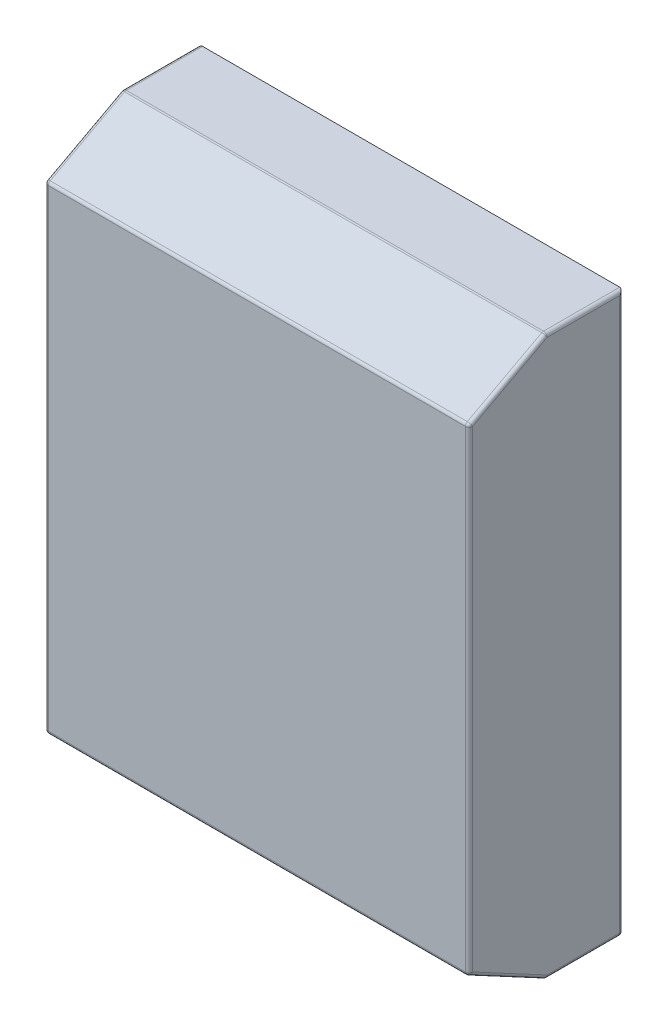
ISO-10303-21;
HEADER;
FILE_DESCRIPTION(('STEP AP214'),'2;1');
FILE_NAME('part.step','',(''),(''),'','','');
FILE_SCHEMA(('AUTOMOTIVE_DESIGN { 1 0 10303 214 1 1 1 1 }'));
ENDSEC;
DATA;
#1=APPLICATION_CONTEXT('core data for automotive mechanical design processes');
#2=APPLICATION_PROTOCOL_DEFINITION('international standard','automotive_design',2000,#1);
#3=PRODUCT_CONTEXT('',#1,'mechanical');
#4=PRODUCT('Part','Part','',(#3));
#5=PRODUCT_RELATED_PRODUCT_CATEGORY('part','',(#4));
#6=PRODUCT_DEFINITION_FORMATION('','',#4);
#7=PRODUCT_DEFINITION_CONTEXT('part definition',#1,'design');
#8=PRODUCT_DEFINITION('design','',#6,#7);
#9=PRODUCT_DEFINITION_SHAPE('','',#8);
#10=(LENGTH_UNIT() NAMED_UNIT(*) SI_UNIT(.MILLI.,.METRE.));
#11=(NAMED_UNIT(*) PLANE_ANGLE_UNIT() SI_UNIT($,.RADIAN.));
#12=(NAMED_UNIT(*) SI_UNIT($,.STERADIAN.) SOLID_ANGLE_UNIT());
#13=UNCERTAINTY_MEASURE_WITH_UNIT(LENGTH_MEASURE(1.E-05),#10,'distance_accuracy_value','');
#14=(GEOMETRIC_REPRESENTATION_CONTEXT(3) GLOBAL_UNCERTAINTY_ASSIGNED_CONTEXT((#13)) GLOBAL_UNIT_ASSIGNED_CONTEXT((#10,
#11,#12)) REPRESENTATION_CONTEXT('',''));
#15=CARTESIAN_POINT('',(0.,0.,0.));
#16=DIRECTION('',(0.,0.,1.));
#17=DIRECTION('',(1.,0.,0.));
#18=AXIS2_PLACEMENT_3D('',#15,#16,#17);
#19=CARTESIAN_POINT('',(-74.0510537034673,169.939067524116,101.6));
#20=DIRECTION('',(1.,0.,0.));
#21=DIRECTION('',(0.,1.,0.));
#22=AXIS2_PLACEMENT_3D('',#19,#20,#21);
#23=PLANE('',#22);
#24=DIRECTION('',(0.,-1.,0.));
#25=VECTOR('',#24,1.);
#26=CARTESIAN_POINT('',(-74.0510537034673,169.939067524116,2.37999999999999));
#27=LINE('',#26,#25);
#28=CARTESIAN_POINT('',(-74.0510537034673,167.559067524116,2.37999999999999));
#29=VERTEX_POINT('',#28);
#30=CARTESIAN_POINT('',(-74.0510537034673,-195.980932475884,2.37999999999999));
#31=VERTEX_POINT('',#30);
#32=EDGE_CURVE('E246',#29,#31,#27,.T.);
#33=ORIENTED_EDGE('',*,*,#32,.T.);
#34=DIRECTION('',(0.,0.,-1.));
#35=VECTOR('',#34,1.);
#36=CARTESIAN_POINT('',(-74.0510537034673,-195.980932475884,101.6));
#37=LINE('',#36,#35);
#38=CARTESIAN_POINT('',(-74.0510537034673,-195.980932475884,50.2034309534252));
#39=VERTEX_POINT('',#38);
#40=EDGE_CURVE('E254',#31,#39,#37,.F.);
#41=ORIENTED_EDGE('',*,*,#40,.T.);
#42=DIRECTION('',(0.,-0.471682672938411,-0.881768368705567));
#43=VECTOR('',#42,1.);
#44=CARTESIAN_POINT('',(-74.0510537034673,-93.1927912794307,242.356623735448));
#45=LINE('',#44,#43);
#46=CARTESIAN_POINT('',(-74.0510537034673,-169.760592614863,99.22));
#47=VERTEX_POINT('',#46);
#48=EDGE_CURVE('E252',#39,#47,#45,.F.);
#49=ORIENTED_EDGE('',*,*,#48,.T.);
#50=DIRECTION('',(0.,-1.,0.));
#51=VECTOR('',#50,1.);
#52=CARTESIAN_POINT('',(-74.0510537034673,142.764720342161,99.22));
#53=LINE('',#52,#51);
#54=CARTESIAN_POINT('',(-74.0510537034673,141.338727663094,99.22));
#55=VERTEX_POINT('',#54);
#56=EDGE_CURVE('E250',#47,#55,#53,.F.);
#57=ORIENTED_EDGE('',*,*,#56,.T.);
#58=DIRECTION('',(0.,-0.471682672938411,0.881768368705567));
#59=VECTOR('',#58,1.);
#60=CARTESIAN_POINT('',(-74.0510537034673,146.711983864566,89.1751804057301));
#61=LINE('',#60,#59);
#62=CARTESIAN_POINT('',(-74.0510537034673,167.559067524116,50.2034309534251));
#63=VERTEX_POINT('',#62);
#64=EDGE_CURVE('E248',#55,#63,#61,.F.);
#65=ORIENTED_EDGE('',*,*,#64,.T.);
#66=DIRECTION('',(0.,0.,-1.));
#67=VECTOR('',#66,1.);
#68=CARTESIAN_POINT('',(-74.0510537034673,167.559067524116,101.6));
#69=LINE('',#68,#67);
#70=EDGE_CURVE('E244',#63,#29,#69,.T.);
#71=ORIENTED_EDGE('',*,*,#70,.T.);
#72=EDGE_LOOP('',(#33,#41,#49,#57,#65,#71));
#73=FACE_BOUND('',#72,.T.);
#74=ADVANCED_FACE('F38',(#73),#23,.F.);
#75=CARTESIAN_POINT('',(-74.0510537034673,-198.360932475884,101.6));
#76=DIRECTION('',(0.,1.,0.));
#77=DIRECTION('',(0.,0.,1.));
#78=AXIS2_PLACEMENT_3D('',#75,#76,#77);
#79=PLANE('',#78);
#80=DIRECTION('',(0.,0.,-1.));
#81=VECTOR('',#80,1.);
#82=CARTESIAN_POINT('',(-71.6710537034673,-198.360932475884,101.6));
#83=LINE('',#82,#81);
#84=CARTESIAN_POINT('',(-71.6710537034673,-198.360932475884,50.2034309534252));
#85=VERTEX_POINT('',#84);
#86=CARTESIAN_POINT('',(-71.6710537034673,-198.360932475884,2.37999999999999));
#87=VERTEX_POINT('',#86);
#88=EDGE_CURVE('E232',#85,#87,#83,.T.);
#89=ORIENTED_EDGE('',*,*,#88,.T.);
#90=DIRECTION('',(1.,0.,0.));
#91=VECTOR('',#90,1.);
#92=CARTESIAN_POINT('',(-74.0510537034673,-198.360932475884,2.37999999999999));
#93=LINE('',#92,#91);
#94=CARTESIAN_POINT('',(202.968946296533,-198.360932475884,2.37999999999999));
#95=VERTEX_POINT('',#94);
#96=EDGE_CURVE('E234',#87,#95,#93,.T.);
#97=ORIENTED_EDGE('',*,*,#96,.T.);
#98=DIRECTION('',(0.,0.,-1.));
#99=VECTOR('',#98,1.);
#100=CARTESIAN_POINT('',(202.968946296533,-198.360932475884,101.6));
#101=LINE('',#100,#99);
#102=CARTESIAN_POINT('',(202.968946296533,-198.360932475884,50.2034309534251));
#103=VERTEX_POINT('',#102);
#104=EDGE_CURVE('E228',#95,#103,#101,.F.);
#105=ORIENTED_EDGE('',*,*,#104,.T.);
#106=DIRECTION('',(-1.,0.,0.));
#107=VECTOR('',#106,1.);
#108=CARTESIAN_POINT('',(-74.0510537034673,-198.360932475884,50.2034309534252));
#109=LINE('',#108,#107);
#110=EDGE_CURVE('E230',#103,#85,#109,.T.);
#111=ORIENTED_EDGE('',*,*,#110,.T.);
#112=EDGE_LOOP('',(#89,#97,#105,#111));
#113=FACE_BOUND('',#112,.T.);
#114=ADVANCED_FACE('F505',(#113),#79,.F.);
#115=CARTESIAN_POINT('',(205.348946296533,169.939067524116,101.6));
#116=DIRECTION('',(-1.,0.,0.));
#117=DIRECTION('',(0.,0.,1.));
#118=AXIS2_PLACEMENT_3D('',#115,#116,#117);
#119=PLANE('',#118);
#120=DIRECTION('',(0.,-0.471682672938411,-0.881768368705567));
#121=VECTOR('',#120,1.);
#122=CARTESIAN_POINT('',(205.348946296533,-93.1927912794306,242.356623735448));
#123=LINE('',#122,#121);
#124=CARTESIAN_POINT('',(205.348946296533,-169.760592614863,99.22));
#125=VERTEX_POINT('',#124);
#126=CARTESIAN_POINT('',(205.348946296533,-195.980932475884,50.2034309534249));
#127=VERTEX_POINT('',#126);
#128=EDGE_CURVE('E274',#125,#127,#123,.T.);
#129=ORIENTED_EDGE('',*,*,#128,.T.);
#130=DIRECTION('',(0.,0.,-1.));
#131=VECTOR('',#130,1.);
#132=CARTESIAN_POINT('',(205.348946296533,-195.980932475884,101.6));
#133=LINE('',#132,#131);
#134=CARTESIAN_POINT('',(205.348946296533,-195.980932475884,2.37999999999999));
#135=VERTEX_POINT('',#134);
#136=EDGE_CURVE('E276',#127,#135,#133,.T.);
#137=ORIENTED_EDGE('',*,*,#136,.T.);
#138=DIRECTION('',(0.,1.,0.));
#139=VECTOR('',#138,1.);
#140=CARTESIAN_POINT('',(205.348946296533,169.939067524116,2.37999999999999));
#141=LINE('',#140,#139);
#142=CARTESIAN_POINT('',(205.348946296533,167.559067524116,2.37999999999999));
#143=VERTEX_POINT('',#142);
#144=EDGE_CURVE('E272',#135,#143,#141,.T.);
#145=ORIENTED_EDGE('',*,*,#144,.T.);
#146=DIRECTION('',(0.,0.,-1.));
#147=VECTOR('',#146,1.);
#148=CARTESIAN_POINT('',(205.348946296533,167.559067524116,101.6));
#149=LINE('',#148,#147);
#150=CARTESIAN_POINT('',(205.348946296533,167.559067524116,50.2034309534253));
#151=VERTEX_POINT('',#150);
#152=EDGE_CURVE('E268',#143,#151,#149,.F.);
#153=ORIENTED_EDGE('',*,*,#152,.T.);
#154=DIRECTION('',(0.,-0.471682672938411,0.881768368705567));
#155=VECTOR('',#154,1.);
#156=CARTESIAN_POINT('',(205.348946296533,146.711983864567,89.1751804057302));
#157=LINE('',#156,#155);
#158=CARTESIAN_POINT('',(205.348946296533,141.338727663094,99.22));
#159=VERTEX_POINT('',#158);
#160=EDGE_CURVE('E266',#151,#159,#157,.T.);
#161=ORIENTED_EDGE('',*,*,#160,.T.);
#162=DIRECTION('',(0.,1.,0.));
#163=VECTOR('',#162,1.);
#164=CARTESIAN_POINT('',(205.348946296533,-171.186585293929,99.22));
#165=LINE('',#164,#163);
#166=EDGE_CURVE('E270',#159,#125,#165,.F.);
#167=ORIENTED_EDGE('',*,*,#166,.T.);
#168=EDGE_LOOP('',(#129,#137,#145,#153,#161,#167));
#169=FACE_BOUND('',#168,.T.);
#170=ADVANCED_FACE('F507',(#169),#119,.F.);
#171=CARTESIAN_POINT('',(-74.0510537034673,169.939067524116,101.6));
#172=DIRECTION('',(0.,-1.,0.));
#173=DIRECTION('',(1.,0.,0.));
#174=AXIS2_PLACEMENT_3D('',#171,#172,#173);
#175=PLANE('',#174);
#176=DIRECTION('',(-1.,0.,0.));
#177=VECTOR('',#176,1.);
#178=CARTESIAN_POINT('',(-74.0510537034673,169.939067524116,50.2034309534251));
#179=LINE('',#178,#177);
#180=CARTESIAN_POINT('',(-71.6710537034673,169.939067524116,50.2034309534251));
#181=VERTEX_POINT('',#180);
#182=CARTESIAN_POINT('',(202.968946296533,169.939067524116,50.2034309534253));
#183=VERTEX_POINT('',#182);
#184=EDGE_CURVE('E47',#181,#183,#179,.F.);
#185=ORIENTED_EDGE('',*,*,#184,.T.);
#186=DIRECTION('',(0.,0.,-1.));
#187=VECTOR('',#186,1.);
#188=CARTESIAN_POINT('',(202.968946296533,169.939067524116,101.6));
#189=LINE('',#188,#187);
#190=CARTESIAN_POINT('',(202.968946296533,169.939067524116,0.));
#191=VERTEX_POINT('',#190);
#192=EDGE_CURVE('E11',#183,#191,#189,.T.);
#193=ORIENTED_EDGE('',*,*,#192,.T.);
#194=DIRECTION('',(-1.,0.,0.));
#195=VECTOR('',#194,1.);
#196=CARTESIAN_POINT('',(-74.0510537034673,169.939067524116,0.));
#197=LINE('',#196,#195);
#198=CARTESIAN_POINT('',(-71.6710537034673,169.939067524116,0.));
#199=VERTEX_POINT('',#198);
#200=EDGE_CURVE('E213',#191,#199,#197,.T.);
#201=ORIENTED_EDGE('',*,*,#200,.T.);
#202=DIRECTION('',(0.,0.,-1.));
#203=VECTOR('',#202,1.);
#204=CARTESIAN_POINT('',(-71.6710537034673,169.939067524116,101.6));
#205=LINE('',#204,#203);
#206=EDGE_CURVE('E58',#199,#181,#205,.F.);
#207=ORIENTED_EDGE('',*,*,#206,.T.);
#208=EDGE_LOOP('',(#185,#193,#201,#207));
#209=FACE_BOUND('',#208,.T.);
#210=ADVANCED_FACE('F487',(#209),#175,.F.);
#211=CARTESIAN_POINT('',(0.,0.,101.6));
#212=DIRECTION('',(0.,0.,1.));
#213=DIRECTION('',(1.,0.,0.));
#214=AXIS2_PLACEMENT_3D('',#211,#212,#213);
#215=PLANE('',#214);
#216=DIRECTION('',(0.,-1.,0.));
#217=VECTOR('',#216,1.);
#218=CARTESIAN_POINT('',(-71.6710537034673,-171.186585293929,101.6));
#219=LINE('',#218,#217);
#220=CARTESIAN_POINT('',(-71.6710537034673,141.338727663094,101.6));
#221=VERTEX_POINT('',#220);
#222=CARTESIAN_POINT('',(-71.6710537034673,-169.760592614863,101.6));
#223=VERTEX_POINT('',#222);
#224=EDGE_CURVE('E283',#221,#223,#219,.T.);
#225=ORIENTED_EDGE('',*,*,#224,.T.);
#226=DIRECTION('',(-1.,0.,0.));
#227=VECTOR('',#226,1.);
#228=CARTESIAN_POINT('',(205.348946296533,-169.760592614863,101.6));
#229=LINE('',#228,#227);
#230=CARTESIAN_POINT('',(202.968946296533,-169.760592614863,101.6));
#231=VERTEX_POINT('',#230);
#232=EDGE_CURVE('E285',#223,#231,#229,.F.);
#233=ORIENTED_EDGE('',*,*,#232,.T.);
#234=DIRECTION('',(0.,1.,0.));
#235=VECTOR('',#234,1.);
#236=CARTESIAN_POINT('',(202.968946296533,142.764720342161,101.6));
#237=LINE('',#236,#235);
#238=CARTESIAN_POINT('',(202.968946296533,141.338727663094,101.6));
#239=VERTEX_POINT('',#238);
#240=EDGE_CURVE('E281',#231,#239,#237,.T.);
#241=ORIENTED_EDGE('',*,*,#240,.T.);
#242=DIRECTION('',(1.,0.,0.));
#243=VECTOR('',#242,1.);
#244=CARTESIAN_POINT('',(-74.0510537034672,141.338727663094,101.6));
#245=LINE('',#244,#243);
#246=EDGE_CURVE('E279',#239,#221,#245,.F.);
#247=ORIENTED_EDGE('',*,*,#246,.T.);
#248=EDGE_LOOP('',(#225,#233,#241,#247));
#249=FACE_BOUND('',#248,.T.);
#250=ADVANCED_FACE('F419',(#249),#215,.T.);
#251=CARTESIAN_POINT('',(0.,0.,0.));
#252=DIRECTION('',(0.,0.,1.));
#253=DIRECTION('',(1.,0.,0.));
#254=AXIS2_PLACEMENT_3D('',#251,#252,#253);
#255=PLANE('',#254);
#256=ORIENTED_EDGE('',*,*,#200,.F.);
#257=DIRECTION('',(0.,1.,0.));
#258=VECTOR('',#257,1.);
#259=CARTESIAN_POINT('',(202.968946296533,0.,0.));
#260=LINE('',#259,#258);
#261=CARTESIAN_POINT('',(202.968946296533,-195.980932475884,0.));
#262=VERTEX_POINT('',#261);
#263=EDGE_CURVE('E242',#191,#262,#260,.F.);
#264=ORIENTED_EDGE('',*,*,#263,.T.);
#265=DIRECTION('',(1.,0.,0.));
#266=VECTOR('',#265,1.);
#267=CARTESIAN_POINT('',(0.,-195.980932475884,0.));
#268=LINE('',#267,#266);
#269=CARTESIAN_POINT('',(-71.6710537034673,-195.980932475884,0.));
#270=VERTEX_POINT('',#269);
#271=EDGE_CURVE('E239',#262,#270,#268,.F.);
#272=ORIENTED_EDGE('',*,*,#271,.T.);
#273=DIRECTION('',(0.,-1.,0.));
#274=VECTOR('',#273,1.);
#275=CARTESIAN_POINT('',(-71.6710537034673,0.,0.));
#276=LINE('',#275,#274);
#277=EDGE_CURVE('E237',#270,#199,#276,.F.);
#278=ORIENTED_EDGE('',*,*,#277,.T.);
#279=EDGE_LOOP('',(#256,#264,#272,#278));
#280=FACE_BOUND('',#279,.T.);
#281=ADVANCED_FACE('F489',(#280),#255,.F.);
#282=CARTESIAN_POINT('',(269.610946296533,-198.360932475884,50.8));
#283=DIRECTION('',(0.,0.881768368705567,-0.471682672938411));
#284=DIRECTION('',(0.,0.471682672938411,0.881768368705567));
#285=AXIS2_PLACEMENT_3D('',#282,#283,#284);
#286=PLANE('',#285);
#287=DIRECTION('',(-1.,0.,0.));
#288=VECTOR('',#287,1.);
#289=CARTESIAN_POINT('',(-74.0510537034671,-171.859201332382,100.342604761593));
#290=LINE('',#289,#288);
#291=CARTESIAN_POINT('',(202.968946296533,-171.859201332382,100.342604761593));
#292=VERTEX_POINT('',#291);
#293=CARTESIAN_POINT('',(-71.6710537034673,-171.859201332382,100.342604761593));
#294=VERTEX_POINT('',#293);
#295=EDGE_CURVE('E259',#292,#294,#290,.T.);
#296=ORIENTED_EDGE('',*,*,#295,.T.);
#297=DIRECTION('',(0.,-0.471682672938411,-0.881768368705567));
#298=VECTOR('',#297,1.);
#299=CARTESIAN_POINT('',(-71.6710537034673,-198.360932475884,50.8));
#300=LINE('',#299,#298);
#301=CARTESIAN_POINT('',(-71.6710537034673,-198.079541193403,51.3260357150186));
#302=VERTEX_POINT('',#301);
#303=EDGE_CURVE('E264',#294,#302,#300,.T.);
#304=ORIENTED_EDGE('',*,*,#303,.T.);
#305=DIRECTION('',(-1.,0.,0.));
#306=VECTOR('',#305,1.);
#307=CARTESIAN_POINT('',(269.610946296533,-198.079541193403,51.3260357150184));
#308=LINE('',#307,#306);
#309=CARTESIAN_POINT('',(202.968946296533,-198.079541193403,51.3260357150185));
#310=VERTEX_POINT('',#309);
#311=EDGE_CURVE('E261',#302,#310,#308,.F.);
#312=ORIENTED_EDGE('',*,*,#311,.T.);
#313=DIRECTION('',(0.,-0.471682672938411,-0.881768368705567));
#314=VECTOR('',#313,1.);
#315=CARTESIAN_POINT('',(202.968946296533,-198.360932475884,50.8));
#316=LINE('',#315,#314);
#317=EDGE_CURVE('E257',#310,#292,#316,.F.);
#318=ORIENTED_EDGE('',*,*,#317,.T.);
#319=EDGE_LOOP('',(#296,#304,#312,#318));
#320=FACE_BOUND('',#319,.T.);
#321=DIRECTION('',(-1.,0.,0.));
#322=VECTOR('',#321,1.);
#323=CARTESIAN_POINT('',(269.610946296533,-188.999211424342,68.3008962030973));
#324=LINE('',#323,#322);
#325=CARTESIAN_POINT('',(178.763791471281,-188.999211424342,68.3008962030973));
#326=VERTEX_POINT('',#325);
#327=CARTESIAN_POINT('',(-47.465898878216,-188.999211424342,68.3008962030973));
#328=VERTEX_POINT('',#327);
#329=EDGE_CURVE('E219',#326,#328,#324,.T.);
#330=ORIENTED_EDGE('',*,*,#329,.T.);
#331=CARTESIAN_POINT('',(-47.465898878216,-183.904021327726,77.8258962030973));
#332=DIRECTION('',(0.,0.881768368705567,-0.471682672938411));
#333=DIRECTION('',(0.,-0.471682672938411,-0.881768368705567));
#334=AXIS2_PLACEMENT_3D('',#331,#332,#333);
#335=ELLIPSE('',#334,10.802156595822,9.525);
#336=CARTESIAN_POINT('',(-47.465898878216,-178.808831231109,87.3508962030973));
#337=VERTEX_POINT('',#336);
#338=EDGE_CURVE('E188',#328,#337,#335,.T.);
#339=ORIENTED_EDGE('',*,*,#338,.T.);
#340=DIRECTION('',(1.,0.,0.));
#341=VECTOR('',#340,1.);
#342=CARTESIAN_POINT('',(269.610946296533,-178.808831231109,87.3508962030973));
#343=LINE('',#342,#341);
#344=CARTESIAN_POINT('',(178.763791471281,-178.808831231109,87.3508962030973));
#345=VERTEX_POINT('',#344);
#346=EDGE_CURVE('E224',#337,#345,#343,.T.);
#347=ORIENTED_EDGE('',*,*,#346,.T.);
#348=CARTESIAN_POINT('',(178.763791471281,-183.904021327726,77.8258962030973));
#349=DIRECTION('',(0.,0.881768368705567,-0.471682672938411));
#350=DIRECTION('',(0.,-0.471682672938411,-0.881768368705567));
#351=AXIS2_PLACEMENT_3D('',#348,#349,#350);
#352=ELLIPSE('',#351,10.802156595822,9.525);
#353=EDGE_CURVE('E221',#345,#326,#352,.T.);
#354=ORIENTED_EDGE('',*,*,#353,.T.);
#355=EDGE_LOOP('',(#330,#339,#347,#354));
#356=FACE_BOUND('',#355,.T.);
#357=ADVANCED_FACE('F457',(#320,#356),#286,.F.);
#358=CARTESIAN_POINT('',(269.610946296533,169.939067524116,50.8));
#359=DIRECTION('',(0.,-0.881768368705567,-0.471682672938411));
#360=DIRECTION('',(0.,0.471682672938411,-0.881768368705567));
#361=AXIS2_PLACEMENT_3D('',#358,#359,#360);
#362=PLANE('',#361);
#363=DIRECTION('',(0.,-0.471682672938411,0.881768368705567));
#364=VECTOR('',#363,1.);
#365=CARTESIAN_POINT('',(-71.6710537034673,169.939067524116,50.8));
#366=LINE('',#365,#364);
#367=CARTESIAN_POINT('',(-71.6710537034673,169.657676241635,51.3260357150185));
#368=VERTEX_POINT('',#367);
#369=CARTESIAN_POINT('',(-71.6710537034673,143.437336380613,100.342604761593));
#370=VERTEX_POINT('',#369);
#371=EDGE_CURVE('E290',#368,#370,#366,.T.);
#372=ORIENTED_EDGE('',*,*,#371,.T.);
#373=DIRECTION('',(1.,0.,0.));
#374=VECTOR('',#373,1.);
#375=CARTESIAN_POINT('',(205.348946296533,143.437336380613,100.342604761593));
#376=LINE('',#375,#374);
#377=CARTESIAN_POINT('',(202.968946296533,143.437336380613,100.342604761593));
#378=VERTEX_POINT('',#377);
#379=EDGE_CURVE('E294',#370,#378,#376,.T.);
#380=ORIENTED_EDGE('',*,*,#379,.T.);
#381=DIRECTION('',(0.,-0.471682672938411,0.881768368705567));
#382=VECTOR('',#381,1.);
#383=CARTESIAN_POINT('',(202.968946296533,169.939067524116,50.8));
#384=LINE('',#383,#382);
#385=CARTESIAN_POINT('',(202.968946296533,169.657676241635,51.3260357150187));
#386=VERTEX_POINT('',#385);
#387=EDGE_CURVE('E292',#378,#386,#384,.F.);
#388=ORIENTED_EDGE('',*,*,#387,.T.);
#389=DIRECTION('',(-1.,0.,0.));
#390=VECTOR('',#389,1.);
#391=CARTESIAN_POINT('',(269.610946296533,169.657676241635,51.3260357150187));
#392=LINE('',#391,#390);
#393=EDGE_CURVE('E288',#386,#368,#392,.T.);
#394=ORIENTED_EDGE('',*,*,#393,.T.);
#395=EDGE_LOOP('',(#372,#380,#388,#394));
#396=FACE_BOUND('',#395,.T.);
#397=ADVANCED_FACE('F426',(#396),#362,.F.);
#398=CARTESIAN_POINT('',(-47.465898878216,-119.112932475884,77.8258962030973));
#399=DIRECTION('',(0.,-1.,0.));
#400=DIRECTION('',(0.,0.,-1.));
#401=AXIS2_PLACEMENT_3D('',#398,#399,#400);
#402=CYLINDRICAL_SURFACE('',#401,9.525);
#403=DIRECTION('',(0.,-1.,0.));
#404=VECTOR('',#403,1.);
#405=CARTESIAN_POINT('',(-47.465898878216,-119.112932475884,68.3008962030973));
#406=LINE('',#405,#404);
#407=CARTESIAN_POINT('',(-47.465898878216,-119.112932475884,68.3008962030973));
#408=VERTEX_POINT('',#407);
#409=EDGE_CURVE('E180',#408,#328,#406,.T.);
#410=ORIENTED_EDGE('',*,*,#409,.F.);
#411=CARTESIAN_POINT('',(-47.465898878216,-119.112932475884,77.8258962030973));
#412=DIRECTION('',(0.,-1.,0.));
#413=DIRECTION('',(0.,0.,1.));
#414=AXIS2_PLACEMENT_3D('',#411,#412,#413);
#415=CIRCLE('',#414,9.525);
#416=CARTESIAN_POINT('',(-47.465898878216,-119.112932475884,87.3508962030973));
#417=VERTEX_POINT('',#416);
#418=EDGE_CURVE('E185',#417,#408,#415,.T.);
#419=ORIENTED_EDGE('',*,*,#418,.F.);
#420=DIRECTION('',(0.,-1.,0.));
#421=VECTOR('',#420,1.);
#422=CARTESIAN_POINT('',(-47.465898878216,-119.112932475884,87.3508962030973));
#423=LINE('',#422,#421);
#424=EDGE_CURVE('E211',#417,#337,#423,.T.);
#425=ORIENTED_EDGE('',*,*,#424,.T.);
#426=ORIENTED_EDGE('',*,*,#338,.F.);
#427=EDGE_LOOP('',(#410,#419,#425,#426));
#428=FACE_BOUND('',#427,.T.);
#429=ADVANCED_FACE('F182',(#428),#402,.F.);
#430=CARTESIAN_POINT('',(-47.465898878216,-119.112932475884,87.3508962030973));
#431=DIRECTION('',(0.,0.,1.));
#432=DIRECTION('',(1.,0.,0.));
#433=AXIS2_PLACEMENT_3D('',#430,#431,#432);
#434=PLANE('',#433);
#435=ORIENTED_EDGE('',*,*,#424,.F.);
#436=DIRECTION('',(-1.,0.,0.));
#437=VECTOR('',#436,1.);
#438=CARTESIAN_POINT('',(-47.465898878216,-119.112932475884,87.3508962030973));
#439=LINE('',#438,#437);
#440=CARTESIAN_POINT('',(178.763791471281,-119.112932475884,87.3508962030973));
#441=VERTEX_POINT('',#440);
#442=EDGE_CURVE('E192',#441,#417,#439,.T.);
#443=ORIENTED_EDGE('',*,*,#442,.F.);
#444=DIRECTION('',(0.,-1.,0.));
#445=VECTOR('',#444,1.);
#446=CARTESIAN_POINT('',(178.763791471281,-119.112932475884,87.3508962030973));
#447=LINE('',#446,#445);
#448=EDGE_CURVE('E214',#441,#345,#447,.T.);
#449=ORIENTED_EDGE('',*,*,#448,.T.);
#450=ORIENTED_EDGE('',*,*,#346,.F.);
#451=EDGE_LOOP('',(#435,#443,#449,#450));
#452=FACE_BOUND('',#451,.T.);
#453=ADVANCED_FACE('F587',(#452),#434,.F.);
#454=CARTESIAN_POINT('',(178.763791471281,-119.112932475884,77.8258962030973));
#455=DIRECTION('',(0.,-1.,0.));
#456=DIRECTION('',(0.,0.,-1.));
#457=AXIS2_PLACEMENT_3D('',#454,#455,#456);
#458=CYLINDRICAL_SURFACE('',#457,9.525);
#459=ORIENTED_EDGE('',*,*,#448,.F.);
#460=CARTESIAN_POINT('',(178.763791471281,-119.112932475884,77.8258962030973));
#461=DIRECTION('',(0.,-1.,0.));
#462=DIRECTION('',(0.,0.,-1.));
#463=AXIS2_PLACEMENT_3D('',#460,#461,#462);
#464=CIRCLE('',#463,9.525);
#465=CARTESIAN_POINT('',(178.763791471281,-119.112932475884,68.3008962030973));
#466=VERTEX_POINT('',#465);
#467=EDGE_CURVE('E201',#466,#441,#464,.T.);
#468=ORIENTED_EDGE('',*,*,#467,.F.);
#469=DIRECTION('',(0.,-1.,0.));
#470=VECTOR('',#469,1.);
#471=CARTESIAN_POINT('',(178.763791471281,-119.112932475884,68.3008962030973));
#472=LINE('',#471,#470);
#473=EDGE_CURVE('E191',#466,#326,#472,.T.);
#474=ORIENTED_EDGE('',*,*,#473,.T.);
#475=ORIENTED_EDGE('',*,*,#353,.F.);
#476=EDGE_LOOP('',(#459,#468,#474,#475));
#477=FACE_BOUND('',#476,.T.);
#478=ADVANCED_FACE('F584',(#477),#458,.F.);
#479=CARTESIAN_POINT('',(178.763791471281,-119.112932475884,68.3008962030973));
#480=DIRECTION('',(0.,0.,-1.));
#481=DIRECTION('',(-1.,0.,0.));
#482=AXIS2_PLACEMENT_3D('',#479,#480,#481);
#483=PLANE('',#482);
#484=ORIENTED_EDGE('',*,*,#473,.F.);
#485=DIRECTION('',(1.,0.,0.));
#486=VECTOR('',#485,1.);
#487=CARTESIAN_POINT('',(178.763791471281,-119.112932475884,68.3008962030973));
#488=LINE('',#487,#486);
#489=EDGE_CURVE('E195',#408,#466,#488,.T.);
#490=ORIENTED_EDGE('',*,*,#489,.F.);
#491=ORIENTED_EDGE('',*,*,#409,.T.);
#492=ORIENTED_EDGE('',*,*,#329,.F.);
#493=EDGE_LOOP('',(#484,#490,#491,#492));
#494=FACE_BOUND('',#493,.T.);
#495=ADVANCED_FACE('F196',(#494),#483,.F.);
#496=CARTESIAN_POINT('',(-47.465898878216,-119.112932475884,77.8258962030973));
#497=DIRECTION('',(0.,1.,0.));
#498=DIRECTION('',(0.,0.,1.));
#499=AXIS2_PLACEMENT_3D('',#496,#497,#498);
#500=PLANE('',#499);
#501=ORIENTED_EDGE('',*,*,#418,.T.);
#502=ORIENTED_EDGE('',*,*,#489,.T.);
#503=ORIENTED_EDGE('',*,*,#467,.T.);
#504=ORIENTED_EDGE('',*,*,#442,.T.);
#505=EDGE_LOOP('',(#501,#502,#503,#504));
#506=FACE_BOUND('',#505,.T.);
#507=ADVANCED_FACE('F203',(#506),#500,.F.);
#508=CARTESIAN_POINT('',(269.610946296533,141.338727663094,99.22));
#509=DIRECTION('',(-1.,0.,0.));
#510=DIRECTION('',(0.,-1.,0.));
#511=AXIS2_PLACEMENT_3D('',#508,#509,#510);
#512=CYLINDRICAL_SURFACE('',#511,2.38);
#513=CARTESIAN_POINT('',(-71.6710537034673,141.338727663094,99.22));
#514=DIRECTION('',(-1.,0.,0.));
#515=DIRECTION('',(0.,-1.,0.));
#516=AXIS2_PLACEMENT_3D('',#513,#514,#515);
#517=CIRCLE('',#516,2.38);
#518=EDGE_CURVE('E42',#221,#370,#517,.T.);
#519=ORIENTED_EDGE('',*,*,#518,.F.);
#520=ORIENTED_EDGE('',*,*,#246,.F.);
#521=CARTESIAN_POINT('',(202.968946296533,141.338727663094,99.22));
#522=DIRECTION('',(1.,0.,0.));
#523=DIRECTION('',(0.,0.,-1.));
#524=AXIS2_PLACEMENT_3D('',#521,#522,#523);
#525=CIRCLE('',#524,2.38);
#526=EDGE_CURVE('E377',#378,#239,#525,.T.);
#527=ORIENTED_EDGE('',*,*,#526,.F.);
#528=ORIENTED_EDGE('',*,*,#379,.F.);
#529=EDGE_LOOP('',(#519,#520,#527,#528));
#530=FACE_BOUND('',#529,.T.);
#531=ADVANCED_FACE('F40',(#530),#512,.T.);
#532=CARTESIAN_POINT('',(-71.6710537034673,141.338727663094,99.22));
#533=DIRECTION('',(0.,0.,1.));
#534=DIRECTION('',(1.,0.,0.));
#535=AXIS2_PLACEMENT_3D('',#532,#533,#534);
#536=SPHERICAL_SURFACE('',#535,2.38);
#537=CARTESIAN_POINT('',(-71.6710537034673,141.338727663094,99.22));
#538=DIRECTION('',(0.,-0.471682672938411,0.881768368705567));
#539=DIRECTION('',(0.,-0.881768368705567,-0.471682672938411));
#540=AXIS2_PLACEMENT_3D('',#537,#538,#539);
#541=CIRCLE('',#540,2.38);
#542=EDGE_CURVE('E374',#55,#370,#541,.F.);
#543=ORIENTED_EDGE('',*,*,#542,.F.);
#544=CARTESIAN_POINT('',(-71.6710537034673,141.338727663094,99.22));
#545=DIRECTION('',(0.,1.,0.));
#546=DIRECTION('',(0.,0.,1.));
#547=AXIS2_PLACEMENT_3D('',#544,#545,#546);
#548=CIRCLE('',#547,2.38);
#549=EDGE_CURVE('E207',#221,#55,#548,.F.);
#550=ORIENTED_EDGE('',*,*,#549,.F.);
#551=ORIENTED_EDGE('',*,*,#518,.T.);
#552=EDGE_LOOP('',(#543,#550,#551));
#553=FACE_BOUND('',#552,.T.);
#554=ADVANCED_FACE('F392',(#553),#536,.T.);
#555=CARTESIAN_POINT('',(-71.6710537034673,0.,99.22));
#556=DIRECTION('',(0.,1.,0.));
#557=DIRECTION('',(-1.,0.,0.));
#558=AXIS2_PLACEMENT_3D('',#555,#556,#557);
#559=CYLINDRICAL_SURFACE('',#558,2.38);
#560=ORIENTED_EDGE('',*,*,#549,.T.);
#561=ORIENTED_EDGE('',*,*,#56,.F.);
#562=CARTESIAN_POINT('',(-71.6710537034673,-169.760592614863,99.22));
#563=DIRECTION('',(0.,-1.,0.));
#564=DIRECTION('',(1.,0.,0.));
#565=AXIS2_PLACEMENT_3D('',#562,#563,#564);
#566=CIRCLE('',#565,2.38);
#567=EDGE_CURVE('E371',#223,#47,#566,.T.);
#568=ORIENTED_EDGE('',*,*,#567,.F.);
#569=ORIENTED_EDGE('',*,*,#224,.F.);
#570=EDGE_LOOP('',(#560,#561,#568,#569));
#571=FACE_BOUND('',#570,.T.);
#572=ADVANCED_FACE('F388',(#571),#559,.T.);
#573=CARTESIAN_POINT('',(269.610946296533,-169.760592614863,99.22));
#574=DIRECTION('',(1.,0.,0.));
#575=DIRECTION('',(0.,1.,0.));
#576=AXIS2_PLACEMENT_3D('',#573,#574,#575);
#577=CYLINDRICAL_SURFACE('',#576,2.38);
#578=CARTESIAN_POINT('',(202.968946296533,-169.760592614863,99.22));
#579=DIRECTION('',(1.,0.,0.));
#580=DIRECTION('',(0.,0.,-1.));
#581=AXIS2_PLACEMENT_3D('',#578,#579,#580);
#582=CIRCLE('',#581,2.38);
#583=EDGE_CURVE('E365',#231,#292,#582,.T.);
#584=ORIENTED_EDGE('',*,*,#583,.F.);
#585=ORIENTED_EDGE('',*,*,#232,.F.);
#586=CARTESIAN_POINT('',(-71.6710537034673,-169.760592614863,99.22));
#587=DIRECTION('',(-1.,0.,0.));
#588=DIRECTION('',(0.,0.,1.));
#589=AXIS2_PLACEMENT_3D('',#586,#587,#588);
#590=CIRCLE('',#589,2.38);
#591=EDGE_CURVE('E368',#294,#223,#590,.T.);
#592=ORIENTED_EDGE('',*,*,#591,.F.);
#593=ORIENTED_EDGE('',*,*,#295,.F.);
#594=EDGE_LOOP('',(#584,#585,#592,#593));
#595=FACE_BOUND('',#594,.T.);
#596=ADVANCED_FACE('F416',(#595),#577,.T.);
#597=CARTESIAN_POINT('',(202.968946296533,0.,99.22));
#598=DIRECTION('',(0.,-1.,0.));
#599=DIRECTION('',(0.,0.,-1.));
#600=AXIS2_PLACEMENT_3D('',#597,#598,#599);
#601=CYLINDRICAL_SURFACE('',#600,2.38);
#602=CARTESIAN_POINT('',(202.968946296533,141.338727663094,99.22));
#603=DIRECTION('',(0.,1.,0.));
#604=DIRECTION('',(0.,0.,1.));
#605=AXIS2_PLACEMENT_3D('',#602,#603,#604);
#606=CIRCLE('',#605,2.38);
#607=EDGE_CURVE('E380',#239,#159,#606,.T.);
#608=ORIENTED_EDGE('',*,*,#607,.F.);
#609=ORIENTED_EDGE('',*,*,#240,.F.);
#610=CARTESIAN_POINT('',(202.968946296533,-169.760592614863,99.22));
#611=DIRECTION('',(0.,-1.,0.));
#612=DIRECTION('',(0.,0.,-1.));
#613=AXIS2_PLACEMENT_3D('',#610,#611,#612);
#614=CIRCLE('',#613,2.38);
#615=EDGE_CURVE('E363',#125,#231,#614,.T.);
#616=ORIENTED_EDGE('',*,*,#615,.F.);
#617=ORIENTED_EDGE('',*,*,#166,.F.);
#618=EDGE_LOOP('',(#608,#609,#616,#617));
#619=FACE_BOUND('',#618,.T.);
#620=ADVANCED_FACE('F470',(#619),#601,.T.);
#621=CARTESIAN_POINT('',(202.968946296533,141.338727663094,99.22));
#622=DIRECTION('',(0.,0.,1.));
#623=DIRECTION('',(1.,0.,0.));
#624=AXIS2_PLACEMENT_3D('',#621,#622,#623);
#625=SPHERICAL_SURFACE('',#624,2.38);
#626=ORIENTED_EDGE('',*,*,#526,.T.);
#627=ORIENTED_EDGE('',*,*,#607,.T.);
#628=CARTESIAN_POINT('',(202.968946296533,141.338727663094,99.22));
#629=DIRECTION('',(0.,-0.471682672938411,0.881768368705567));
#630=DIRECTION('',(0.,-0.881768368705567,-0.471682672938411));
#631=AXIS2_PLACEMENT_3D('',#628,#629,#630);
#632=CIRCLE('',#631,2.38);
#633=EDGE_CURVE('E360',#378,#159,#632,.F.);
#634=ORIENTED_EDGE('',*,*,#633,.F.);
#635=EDGE_LOOP('',(#626,#627,#634));
#636=FACE_BOUND('',#635,.T.);
#637=ADVANCED_FACE('F473',(#636),#625,.T.);
#638=CARTESIAN_POINT('',(-71.6710537034673,167.840458806597,49.6773952384066));
#639=DIRECTION('',(0.,-0.471682672938411,0.881768368705567));
#640=DIRECTION('',(0.,-0.881768368705567,-0.471682672938411));
#641=AXIS2_PLACEMENT_3D('',#638,#639,#640);
#642=CYLINDRICAL_SURFACE('',#641,2.38);
#643=ORIENTED_EDGE('',*,*,#542,.T.);
#644=ORIENTED_EDGE('',*,*,#371,.F.);
#645=CARTESIAN_POINT('',(-71.6710537034673,167.559067524116,50.2034309534251));
#646=DIRECTION('',(0.,0.471682672938401,-0.881768368705572));
#647=DIRECTION('',(0.,0.881768368705572,0.471682672938402));
#648=AXIS2_PLACEMENT_3D('',#645,#646,#647);
#649=CIRCLE('',#648,2.38);
#650=EDGE_CURVE('E354',#63,#368,#649,.T.);
#651=ORIENTED_EDGE('',*,*,#650,.F.);
#652=ORIENTED_EDGE('',*,*,#64,.F.);
#653=EDGE_LOOP('',(#643,#644,#651,#652));
#654=FACE_BOUND('',#653,.T.);
#655=ADVANCED_FACE('F397',(#654),#642,.T.);
#656=CARTESIAN_POINT('',(-71.6710537034673,-169.760592614863,99.22));
#657=DIRECTION('',(0.,0.,1.));
#658=DIRECTION('',(1.,0.,0.));
#659=AXIS2_PLACEMENT_3D('',#656,#657,#658);
#660=SPHERICAL_SURFACE('',#659,2.38);
#661=ORIENTED_EDGE('',*,*,#591,.T.);
#662=ORIENTED_EDGE('',*,*,#567,.T.);
#663=CARTESIAN_POINT('',(-71.6710537034673,-169.760592614863,99.22));
#664=DIRECTION('',(0.,0.471682672938415,0.881768368705564));
#665=DIRECTION('',(0.,-0.881768368705565,0.471682672938415));
#666=AXIS2_PLACEMENT_3D('',#663,#664,#665);
#667=CIRCLE('',#666,2.38);
#668=EDGE_CURVE('E351',#294,#47,#667,.F.);
#669=ORIENTED_EDGE('',*,*,#668,.F.);
#670=EDGE_LOOP('',(#661,#662,#669));
#671=FACE_BOUND('',#670,.T.);
#672=ADVANCED_FACE('F410',(#671),#660,.T.);
#673=CARTESIAN_POINT('',(202.968946296533,-169.760592614863,99.22));
#674=DIRECTION('',(0.,0.,1.));
#675=DIRECTION('',(1.,0.,0.));
#676=AXIS2_PLACEMENT_3D('',#673,#674,#675);
#677=SPHERICAL_SURFACE('',#676,2.38);
#678=ORIENTED_EDGE('',*,*,#615,.T.);
#679=ORIENTED_EDGE('',*,*,#583,.T.);
#680=CARTESIAN_POINT('',(202.968946296533,-169.760592614863,99.22));
#681=DIRECTION('',(0.,0.471682672938411,0.881768368705567));
#682=DIRECTION('',(0.,-0.881768368705567,0.471682672938411));
#683=AXIS2_PLACEMENT_3D('',#680,#681,#682);
#684=CIRCLE('',#683,2.38);
#685=EDGE_CURVE('E348',#125,#292,#684,.F.);
#686=ORIENTED_EDGE('',*,*,#685,.F.);
#687=EDGE_LOOP('',(#678,#679,#686));
#688=FACE_BOUND('',#687,.T.);
#689=ADVANCED_FACE('F466',(#688),#677,.T.);
#690=CARTESIAN_POINT('',(202.968946296533,146.711983864567,89.1751804057302));
#691=DIRECTION('',(0.,-0.471682672938411,0.881768368705567));
#692=DIRECTION('',(0.,-0.881768368705567,-0.471682672938411));
#693=AXIS2_PLACEMENT_3D('',#690,#691,#692);
#694=CYLINDRICAL_SURFACE('',#693,2.38);
#695=ORIENTED_EDGE('',*,*,#633,.T.);
#696=ORIENTED_EDGE('',*,*,#160,.F.);
#697=CARTESIAN_POINT('',(202.968946296533,167.559067524116,50.2034309534253));
#698=DIRECTION('',(0.,0.471682672938413,-0.881768368705565));
#699=DIRECTION('',(0.,0.881768368705566,0.471682672938413));
#700=AXIS2_PLACEMENT_3D('',#697,#698,#699);
#701=CIRCLE('',#700,2.38);
#702=EDGE_CURVE('E345',#386,#151,#701,.T.);
#703=ORIENTED_EDGE('',*,*,#702,.F.);
#704=ORIENTED_EDGE('',*,*,#387,.F.);
#705=EDGE_LOOP('',(#695,#696,#703,#704));
#706=FACE_BOUND('',#705,.T.);
#707=ADVANCED_FACE('F476',(#706),#694,.T.);
#708=CARTESIAN_POINT('',(269.610946296533,167.559067524116,50.2034309534253));
#709=DIRECTION('',(-1.,0.,0.));
#710=DIRECTION('',(0.,0.,1.));
#711=AXIS2_PLACEMENT_3D('',#708,#709,#710);
#712=CYLINDRICAL_SURFACE('',#711,2.38);
#713=CARTESIAN_POINT('',(-71.6710537034673,167.559067524116,50.2034309534251));
#714=DIRECTION('',(-1.,0.,0.));
#715=DIRECTION('',(0.,0.,1.));
#716=AXIS2_PLACEMENT_3D('',#713,#714,#715);
#717=CIRCLE('',#716,2.38);
#718=EDGE_CURVE('E357',#368,#181,#717,.T.);
#719=ORIENTED_EDGE('',*,*,#718,.F.);
#720=ORIENTED_EDGE('',*,*,#393,.F.);
#721=CARTESIAN_POINT('',(202.968946296533,167.559067524116,50.2034309534253));
#722=DIRECTION('',(1.,0.,0.));
#723=DIRECTION('',(0.,0.,-1.));
#724=AXIS2_PLACEMENT_3D('',#721,#722,#723);
#725=CIRCLE('',#724,2.38);
#726=EDGE_CURVE('E342',#183,#386,#725,.T.);
#727=ORIENTED_EDGE('',*,*,#726,.F.);
#728=ORIENTED_EDGE('',*,*,#184,.F.);
#729=EDGE_LOOP('',(#719,#720,#727,#728));
#730=FACE_BOUND('',#729,.T.);
#731=ADVANCED_FACE('F430',(#730),#712,.T.);
#732=CARTESIAN_POINT('',(-71.6710537034673,167.559067524116,50.2034309534251));
#733=DIRECTION('',(0.,0.,1.));
#734=DIRECTION('',(1.,0.,0.));
#735=AXIS2_PLACEMENT_3D('',#732,#733,#734);
#736=SPHERICAL_SURFACE('',#735,2.38);
#737=ORIENTED_EDGE('',*,*,#650,.T.);
#738=ORIENTED_EDGE('',*,*,#718,.T.);
#739=CARTESIAN_POINT('',(-71.6710537034673,167.559067524116,50.2034309534251));
#740=DIRECTION('',(0.,0.,1.));
#741=DIRECTION('',(1.,0.,0.));
#742=AXIS2_PLACEMENT_3D('',#739,#740,#741);
#743=CIRCLE('',#742,2.38);
#744=EDGE_CURVE('E339',#63,#181,#743,.F.);
#745=ORIENTED_EDGE('',*,*,#744,.F.);
#746=EDGE_LOOP('',(#737,#738,#745));
#747=FACE_BOUND('',#746,.T.);
#748=ADVANCED_FACE('F433',(#747),#736,.T.);
#749=CARTESIAN_POINT('',(-71.6710537034673,-196.262323758365,49.6773952384066));
#750=DIRECTION('',(0.,-0.471682672938411,-0.881768368705567));
#751=DIRECTION('',(0.,0.881768368705567,-0.471682672938411));
#752=AXIS2_PLACEMENT_3D('',#749,#750,#751);
#753=CYLINDRICAL_SURFACE('',#752,2.38);
#754=ORIENTED_EDGE('',*,*,#668,.T.);
#755=ORIENTED_EDGE('',*,*,#48,.F.);
#756=CARTESIAN_POINT('',(-71.6710537034673,-195.980932475884,50.2034309534251));
#757=DIRECTION('',(0.,-0.471682672938413,-0.881768368705565));
#758=DIRECTION('',(0.,0.881768368705566,-0.471682672938413));
#759=AXIS2_PLACEMENT_3D('',#756,#757,#758);
#760=CIRCLE('',#759,2.38);
#761=EDGE_CURVE('E336',#302,#39,#760,.T.);
#762=ORIENTED_EDGE('',*,*,#761,.F.);
#763=ORIENTED_EDGE('',*,*,#303,.F.);
#764=EDGE_LOOP('',(#754,#755,#762,#763));
#765=FACE_BOUND('',#764,.T.);
#766=ADVANCED_FACE('F406',(#765),#753,.T.);
#767=CARTESIAN_POINT('',(-74.0510537034673,-195.980932475884,50.2034309534252));
#768=DIRECTION('',(-1.,0.,0.));
#769=DIRECTION('',(0.,0.,1.));
#770=AXIS2_PLACEMENT_3D('',#767,#768,#769);
#771=CYLINDRICAL_SURFACE('',#770,2.38);
#772=CARTESIAN_POINT('',(202.968946296533,-195.980932475884,50.203430953425));
#773=DIRECTION('',(1.,0.,0.));
#774=DIRECTION('',(0.,0.,-1.));
#775=AXIS2_PLACEMENT_3D('',#772,#773,#774);
#776=CIRCLE('',#775,2.38);
#777=EDGE_CURVE('E330',#310,#103,#776,.T.);
#778=ORIENTED_EDGE('',*,*,#777,.F.);
#779=ORIENTED_EDGE('',*,*,#311,.F.);
#780=CARTESIAN_POINT('',(-71.6710537034673,-195.980932475884,50.2034309534252));
#781=DIRECTION('',(-1.,0.,0.));
#782=DIRECTION('',(0.,0.,1.));
#783=AXIS2_PLACEMENT_3D('',#780,#781,#782);
#784=CIRCLE('',#783,2.38);
#785=EDGE_CURVE('E333',#85,#302,#784,.T.);
#786=ORIENTED_EDGE('',*,*,#785,.F.);
#787=ORIENTED_EDGE('',*,*,#110,.F.);
#788=EDGE_LOOP('',(#778,#779,#786,#787));
#789=FACE_BOUND('',#788,.T.);
#790=ADVANCED_FACE('F454',(#789),#771,.T.);
#791=CARTESIAN_POINT('',(202.968946296533,-93.1927912794306,242.356623735448));
#792=DIRECTION('',(0.,-0.471682672938411,-0.881768368705567));
#793=DIRECTION('',(0.,0.881768368705567,-0.471682672938411));
#794=AXIS2_PLACEMENT_3D('',#791,#792,#793);
#795=CYLINDRICAL_SURFACE('',#794,2.38);
#796=ORIENTED_EDGE('',*,*,#685,.T.);
#797=ORIENTED_EDGE('',*,*,#317,.F.);
#798=CARTESIAN_POINT('',(202.968946296533,-195.980932475884,50.2034309534249));
#799=DIRECTION('',(0.,-0.471682672938465,-0.881768368705538));
#800=DIRECTION('',(0.,0.881768368705538,-0.471682672938465));
#801=AXIS2_PLACEMENT_3D('',#798,#799,#800);
#802=CIRCLE('',#801,2.38);
#803=EDGE_CURVE('E328',#127,#310,#802,.T.);
#804=ORIENTED_EDGE('',*,*,#803,.F.);
#805=ORIENTED_EDGE('',*,*,#128,.F.);
#806=EDGE_LOOP('',(#796,#797,#804,#805));
#807=FACE_BOUND('',#806,.T.);
#808=ADVANCED_FACE('F461',(#807),#795,.T.);
#809=CARTESIAN_POINT('',(202.968946296533,167.559067524116,50.2034309534253));
#810=DIRECTION('',(0.,0.,1.));
#811=DIRECTION('',(1.,0.,0.));
#812=AXIS2_PLACEMENT_3D('',#809,#810,#811);
#813=SPHERICAL_SURFACE('',#812,2.38);
#814=ORIENTED_EDGE('',*,*,#726,.T.);
#815=ORIENTED_EDGE('',*,*,#702,.T.);
#816=CARTESIAN_POINT('',(202.968946296533,167.559067524116,50.2034309534253));
#817=DIRECTION('',(0.,0.,1.));
#818=DIRECTION('',(0.,-1.,0.));
#819=AXIS2_PLACEMENT_3D('',#816,#817,#818);
#820=CIRCLE('',#819,2.38);
#821=EDGE_CURVE('E325',#183,#151,#820,.F.);
#822=ORIENTED_EDGE('',*,*,#821,.F.);
#823=EDGE_LOOP('',(#814,#815,#822));
#824=FACE_BOUND('',#823,.T.);
#825=ADVANCED_FACE('F479',(#824),#813,.T.);
#826=CARTESIAN_POINT('',(-71.6710537034673,167.559067524116,101.6));
#827=DIRECTION('',(0.,0.,-1.));
#828=DIRECTION('',(-1.,0.,0.));
#829=AXIS2_PLACEMENT_3D('',#826,#827,#828);
#830=CYLINDRICAL_SURFACE('',#829,2.38);
#831=ORIENTED_EDGE('',*,*,#744,.T.);
#832=ORIENTED_EDGE('',*,*,#206,.F.);
#833=CARTESIAN_POINT('',(-71.6710537034673,167.559067524116,2.37999999999999));
#834=DIRECTION('',(0.,-0.707106781186547,-0.707106781186547));
#835=DIRECTION('',(0.,0.707106781186547,-0.707106781186547));
#836=AXIS2_PLACEMENT_3D('',#833,#834,#835);
#837=ELLIPSE('',#836,3.36582827844796,2.38);
#838=EDGE_CURVE('E322',#29,#199,#837,.T.);
#839=ORIENTED_EDGE('',*,*,#838,.F.);
#840=ORIENTED_EDGE('',*,*,#70,.F.);
#841=EDGE_LOOP('',(#831,#832,#839,#840));
#842=FACE_BOUND('',#841,.T.);
#843=ADVANCED_FACE('F435',(#842),#830,.T.);
#844=CARTESIAN_POINT('',(-71.6710537034673,-195.980932475884,50.2034309534252));
#845=DIRECTION('',(0.,0.,1.));
#846=DIRECTION('',(1.,0.,0.));
#847=AXIS2_PLACEMENT_3D('',#844,#845,#846);
#848=SPHERICAL_SURFACE('',#847,2.38);
#849=ORIENTED_EDGE('',*,*,#785,.T.);
#850=ORIENTED_EDGE('',*,*,#761,.T.);
#851=CARTESIAN_POINT('',(-71.6710537034673,-195.980932475884,50.2034309534252));
#852=DIRECTION('',(0.,0.,1.));
#853=DIRECTION('',(1.,0.,0.));
#854=AXIS2_PLACEMENT_3D('',#851,#852,#853);
#855=CIRCLE('',#854,2.38);
#856=EDGE_CURVE('E320',#85,#39,#855,.F.);
#857=ORIENTED_EDGE('',*,*,#856,.F.);
#858=EDGE_LOOP('',(#849,#850,#857));
#859=FACE_BOUND('',#858,.T.);
#860=ADVANCED_FACE('F448',(#859),#848,.T.);
#861=CARTESIAN_POINT('',(202.968946296533,-195.980932475884,50.2034309534251));
#862=DIRECTION('',(0.,0.,1.));
#863=DIRECTION('',(1.,0.,0.));
#864=AXIS2_PLACEMENT_3D('',#861,#862,#863);
#865=SPHERICAL_SURFACE('',#864,2.38);
#866=ORIENTED_EDGE('',*,*,#803,.T.);
#867=ORIENTED_EDGE('',*,*,#777,.T.);
#868=CARTESIAN_POINT('',(202.968946296533,-195.980932475884,50.2034309534251));
#869=DIRECTION('',(0.,0.,1.));
#870=DIRECTION('',(1.,0.,0.));
#871=AXIS2_PLACEMENT_3D('',#868,#869,#870);
#872=CIRCLE('',#871,2.38);
#873=EDGE_CURVE('E317',#127,#103,#872,.F.);
#874=ORIENTED_EDGE('',*,*,#873,.F.);
#875=EDGE_LOOP('',(#866,#867,#874));
#876=FACE_BOUND('',#875,.T.);
#877=ADVANCED_FACE('F538',(#876),#865,.T.);
#878=CARTESIAN_POINT('',(202.968946296533,167.559067524116,101.6));
#879=DIRECTION('',(0.,0.,-1.));
#880=DIRECTION('',(-1.,0.,0.));
#881=AXIS2_PLACEMENT_3D('',#878,#879,#880);
#882=CYLINDRICAL_SURFACE('',#881,2.38);
#883=ORIENTED_EDGE('',*,*,#821,.T.);
#884=ORIENTED_EDGE('',*,*,#152,.F.);
#885=CARTESIAN_POINT('',(202.968946296533,167.559067524116,2.37999999999999));
#886=DIRECTION('',(0.,-0.707106781186547,-0.707106781186547));
#887=DIRECTION('',(0.,0.707106781186547,-0.707106781186547));
#888=AXIS2_PLACEMENT_3D('',#885,#886,#887);
#889=ELLIPSE('',#888,3.36582827844796,2.38);
#890=EDGE_CURVE('E314',#191,#143,#889,.T.);
#891=ORIENTED_EDGE('',*,*,#890,.F.);
#892=ORIENTED_EDGE('',*,*,#192,.F.);
#893=EDGE_LOOP('',(#883,#884,#891,#892));
#894=FACE_BOUND('',#893,.T.);
#895=ADVANCED_FACE('F484',(#894),#882,.T.);
#896=CARTESIAN_POINT('',(-71.6710537034673,169.939067524116,2.37999999999999));
#897=DIRECTION('',(0.,-1.,0.));
#898=DIRECTION('',(1.,0.,0.));
#899=AXIS2_PLACEMENT_3D('',#896,#897,#898);
#900=CYLINDRICAL_SURFACE('',#899,2.38);
#901=ORIENTED_EDGE('',*,*,#838,.T.);
#902=ORIENTED_EDGE('',*,*,#277,.F.);
#903=CARTESIAN_POINT('',(-71.6710537034673,-195.980932475884,2.37999999999999));
#904=DIRECTION('',(0.,-1.,0.));
#905=DIRECTION('',(0.,0.,-1.));
#906=AXIS2_PLACEMENT_3D('',#903,#904,#905);
#907=CIRCLE('',#906,2.38);
#908=EDGE_CURVE('E311',#31,#270,#907,.T.);
#909=ORIENTED_EDGE('',*,*,#908,.F.);
#910=ORIENTED_EDGE('',*,*,#32,.F.);
#911=EDGE_LOOP('',(#901,#902,#909,#910));
#912=FACE_BOUND('',#911,.T.);
#913=ADVANCED_FACE('F440',(#912),#900,.T.);
#914=CARTESIAN_POINT('',(-71.6710537034673,-195.980932475884,101.6));
#915=DIRECTION('',(0.,0.,-1.));
#916=DIRECTION('',(-1.,0.,0.));
#917=AXIS2_PLACEMENT_3D('',#914,#915,#916);
#918=CYLINDRICAL_SURFACE('',#917,2.38);
#919=ORIENTED_EDGE('',*,*,#856,.T.);
#920=ORIENTED_EDGE('',*,*,#40,.F.);
#921=CARTESIAN_POINT('',(-71.6710537034673,-195.980932475884,2.37999999999999));
#922=DIRECTION('',(0.,0.,-1.));
#923=DIRECTION('',(-1.,0.,0.));
#924=AXIS2_PLACEMENT_3D('',#921,#922,#923);
#925=CIRCLE('',#924,2.38);
#926=EDGE_CURVE('E308',#87,#31,#925,.T.);
#927=ORIENTED_EDGE('',*,*,#926,.F.);
#928=ORIENTED_EDGE('',*,*,#88,.F.);
#929=EDGE_LOOP('',(#919,#920,#927,#928));
#930=FACE_BOUND('',#929,.T.);
#931=ADVANCED_FACE('F443',(#930),#918,.T.);
#932=CARTESIAN_POINT('',(202.968946296533,-195.980932475884,101.6));
#933=DIRECTION('',(0.,0.,-1.));
#934=DIRECTION('',(-1.,0.,0.));
#935=AXIS2_PLACEMENT_3D('',#932,#933,#934);
#936=CYLINDRICAL_SURFACE('',#935,2.38);
#937=ORIENTED_EDGE('',*,*,#873,.T.);
#938=ORIENTED_EDGE('',*,*,#104,.F.);
#939=CARTESIAN_POINT('',(202.968946296533,-195.980932475884,2.37999999999999));
#940=DIRECTION('',(0.,0.,-1.));
#941=DIRECTION('',(-1.,0.,0.));
#942=AXIS2_PLACEMENT_3D('',#939,#940,#941);
#943=CIRCLE('',#942,2.38);
#944=EDGE_CURVE('E305',#135,#95,#943,.T.);
#945=ORIENTED_EDGE('',*,*,#944,.F.);
#946=ORIENTED_EDGE('',*,*,#136,.F.);
#947=EDGE_LOOP('',(#937,#938,#945,#946));
#948=FACE_BOUND('',#947,.T.);
#949=ADVANCED_FACE('F503',(#948),#936,.T.);
#950=CARTESIAN_POINT('',(202.968946296533,169.939067524116,2.37999999999999));
#951=DIRECTION('',(0.,1.,0.));
#952=DIRECTION('',(0.,0.,1.));
#953=AXIS2_PLACEMENT_3D('',#950,#951,#952);
#954=CYLINDRICAL_SURFACE('',#953,2.38);
#955=ORIENTED_EDGE('',*,*,#890,.T.);
#956=ORIENTED_EDGE('',*,*,#144,.F.);
#957=CARTESIAN_POINT('',(202.968946296533,-195.980932475884,2.38));
#958=DIRECTION('',(0.,-1.,0.));
#959=DIRECTION('',(1.,0.,0.));
#960=AXIS2_PLACEMENT_3D('',#957,#958,#959);
#961=CIRCLE('',#960,2.38);
#962=EDGE_CURVE('E303',#262,#135,#961,.T.);
#963=ORIENTED_EDGE('',*,*,#962,.F.);
#964=ORIENTED_EDGE('',*,*,#263,.F.);
#965=EDGE_LOOP('',(#955,#956,#963,#964));
#966=FACE_BOUND('',#965,.T.);
#967=ADVANCED_FACE('F525',(#966),#954,.T.);
#968=CARTESIAN_POINT('',(-71.6710537034673,-195.980932475884,2.38));
#969=DIRECTION('',(0.,0.,1.));
#970=DIRECTION('',(1.,0.,0.));
#971=AXIS2_PLACEMENT_3D('',#968,#969,#970);
#972=SPHERICAL_SURFACE('',#971,2.38);
#973=ORIENTED_EDGE('',*,*,#926,.T.);
#974=ORIENTED_EDGE('',*,*,#908,.T.);
#975=CARTESIAN_POINT('',(-71.6710537034673,-195.980932475884,2.38));
#976=DIRECTION('',(-1.,0.,0.));
#977=DIRECTION('',(0.,0.,1.));
#978=AXIS2_PLACEMENT_3D('',#975,#976,#977);
#979=CIRCLE('',#978,2.38);
#980=EDGE_CURVE('E301',#87,#270,#979,.F.);
#981=ORIENTED_EDGE('',*,*,#980,.F.);
#982=EDGE_LOOP('',(#973,#974,#981));
#983=FACE_BOUND('',#982,.T.);
#984=ADVANCED_FACE('F522',(#983),#972,.T.);
#985=CARTESIAN_POINT('',(202.968946296533,-195.980932475884,2.38));
#986=DIRECTION('',(0.,0.,1.));
#987=DIRECTION('',(1.,0.,0.));
#988=AXIS2_PLACEMENT_3D('',#985,#986,#987);
#989=SPHERICAL_SURFACE('',#988,2.38);
#990=ORIENTED_EDGE('',*,*,#962,.T.);
#991=ORIENTED_EDGE('',*,*,#944,.T.);
#992=CARTESIAN_POINT('',(202.968946296533,-195.980932475884,2.37999999999999));
#993=DIRECTION('',(1.,0.,0.));
#994=DIRECTION('',(0.,0.,-1.));
#995=AXIS2_PLACEMENT_3D('',#992,#993,#994);
#996=CIRCLE('',#995,2.38);
#997=EDGE_CURVE('E299',#262,#95,#996,.F.);
#998=ORIENTED_EDGE('',*,*,#997,.F.);
#999=EDGE_LOOP('',(#990,#991,#998));
#1000=FACE_BOUND('',#999,.T.);
#1001=ADVANCED_FACE('F497',(#1000),#989,.T.);
#1002=CARTESIAN_POINT('',(-74.0510537034673,-195.980932475884,2.37999999999999));
#1003=DIRECTION('',(1.,0.,0.));
#1004=DIRECTION('',(0.,0.,-1.));
#1005=AXIS2_PLACEMENT_3D('',#1002,#1003,#1004);
#1006=CYLINDRICAL_SURFACE('',#1005,2.38);
#1007=ORIENTED_EDGE('',*,*,#980,.T.);
#1008=ORIENTED_EDGE('',*,*,#271,.F.);
#1009=ORIENTED_EDGE('',*,*,#997,.T.);
#1010=ORIENTED_EDGE('',*,*,#96,.F.);
#1011=EDGE_LOOP('',(#1007,#1008,#1009,#1010));
#1012=FACE_BOUND('',#1011,.T.);
#1013=ADVANCED_FACE('F494',(#1012),#1006,.T.);
#1014=CLOSED_SHELL('',(#74,#114,#170,#210,#250,#281,#357,#397,#429,#453,#478,#495,#507,#531,
#554,#572,#596,#620,#637,#655,#672,#689,#707,#731,#748,#766,#790,#808,#825,#843,#860,#877,#895,
#913,#931,#949,#967,#984,#1001,#1013));
#1015=MANIFOLD_SOLID_BREP('B2',#1014);
#1016=ADVANCED_BREP_SHAPE_REPRESENTATION('',(#18,#1015),#14);
#1017=SHAPE_DEFINITION_REPRESENTATION(#9,#1016);
ENDSEC;
END-ISO-10303-21;
